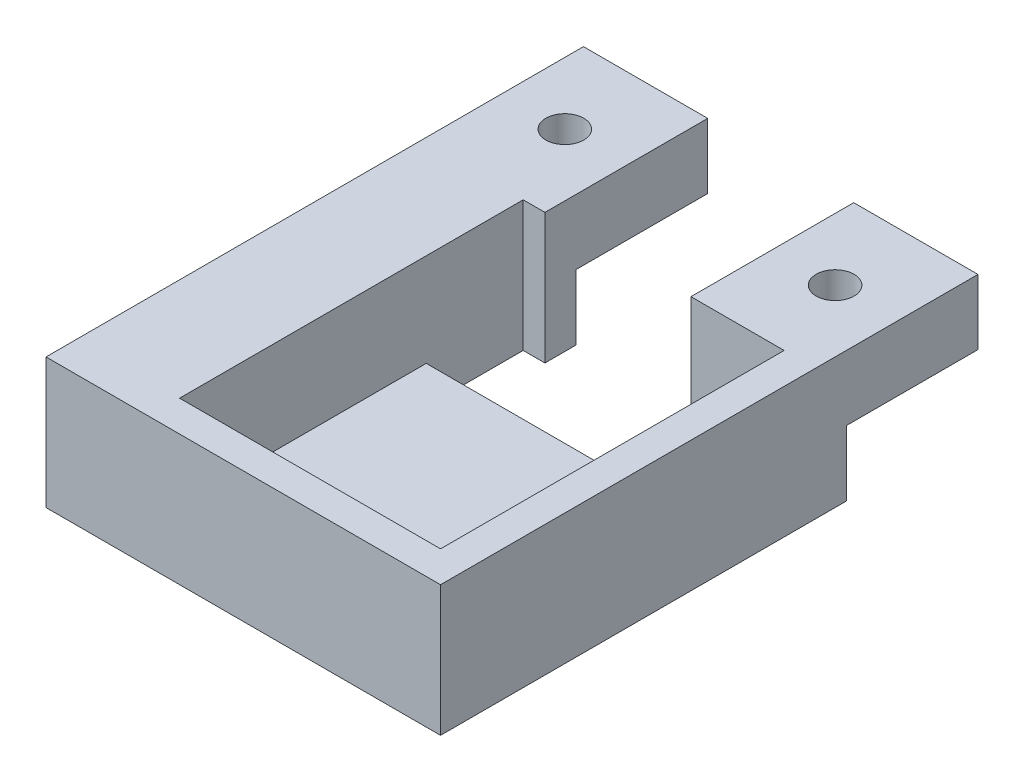
ISO-10303-21;
HEADER;
FILE_DESCRIPTION(('STEP AP214'),'2;1');
FILE_NAME('part.step','',(''),(''),'','','');
FILE_SCHEMA(('AUTOMOTIVE_DESIGN { 1 0 10303 214 1 1 1 1 }'));
ENDSEC;
DATA;
#1=APPLICATION_CONTEXT('core data for automotive mechanical design processes');
#2=APPLICATION_PROTOCOL_DEFINITION('international standard','automotive_design',2000,#1);
#3=PRODUCT_CONTEXT('',#1,'mechanical');
#4=PRODUCT('Part','Part','',(#3));
#5=PRODUCT_RELATED_PRODUCT_CATEGORY('part','',(#4));
#6=PRODUCT_DEFINITION_FORMATION('','',#4);
#7=PRODUCT_DEFINITION_CONTEXT('part definition',#1,'design');
#8=PRODUCT_DEFINITION('design','',#6,#7);
#9=PRODUCT_DEFINITION_SHAPE('','',#8);
#10=(LENGTH_UNIT() NAMED_UNIT(*) SI_UNIT(.MILLI.,.METRE.));
#11=(NAMED_UNIT(*) PLANE_ANGLE_UNIT() SI_UNIT($,.RADIAN.));
#12=(NAMED_UNIT(*) SI_UNIT($,.STERADIAN.) SOLID_ANGLE_UNIT());
#13=UNCERTAINTY_MEASURE_WITH_UNIT(LENGTH_MEASURE(1.E-05),#10,'distance_accuracy_value','');
#14=(GEOMETRIC_REPRESENTATION_CONTEXT(3) GLOBAL_UNCERTAINTY_ASSIGNED_CONTEXT((#13)) GLOBAL_UNIT_ASSIGNED_CONTEXT((#10,
#11,#12)) REPRESENTATION_CONTEXT('',''));
#15=CARTESIAN_POINT('',(0.,0.,0.));
#16=DIRECTION('',(0.,0.,1.));
#17=DIRECTION('',(1.,0.,0.));
#18=AXIS2_PLACEMENT_3D('',#15,#16,#17);
#19=CARTESIAN_POINT('',(21.,6.,0.));
#20=DIRECTION('',(-1.,0.,0.));
#21=DIRECTION('',(0.,0.,1.));
#22=AXIS2_PLACEMENT_3D('',#19,#20,#21);
#23=PLANE('',#22);
#24=DIRECTION('',(0.,0.,-1.));
#25=VECTOR('',#24,1.);
#26=CARTESIAN_POINT('',(21.,0.,0.));
#27=LINE('',#26,#25);
#28=CARTESIAN_POINT('',(21.,0.,-19.85));
#29=VERTEX_POINT('',#28);
#30=CARTESIAN_POINT('',(21.,0.,-35.45));
#31=VERTEX_POINT('',#30);
#32=EDGE_CURVE('E280',#29,#31,#27,.T.);
#33=ORIENTED_EDGE('',*,*,#32,.F.);
#34=DIRECTION('',(0.,-1.,0.));
#35=VECTOR('',#34,1.);
#36=CARTESIAN_POINT('',(21.,6.,-19.85));
#37=LINE('',#36,#35);
#38=CARTESIAN_POINT('',(21.,6.,-19.85));
#39=VERTEX_POINT('',#38);
#40=EDGE_CURVE('E12',#39,#29,#37,.T.);
#41=ORIENTED_EDGE('',*,*,#40,.F.);
#42=DIRECTION('',(0.,0.,1.));
#43=VECTOR('',#42,1.);
#44=CARTESIAN_POINT('',(21.,6.,0.));
#45=LINE('',#44,#43);
#46=CARTESIAN_POINT('',(21.,6.,19.85));
#47=VERTEX_POINT('',#46);
#48=EDGE_CURVE('E278',#39,#47,#45,.T.);
#49=ORIENTED_EDGE('',*,*,#48,.T.);
#50=DIRECTION('',(0.,-1.,0.));
#51=VECTOR('',#50,1.);
#52=CARTESIAN_POINT('',(21.,21.,19.85));
#53=LINE('',#52,#51);
#54=CARTESIAN_POINT('',(21.,21.,19.85));
#55=VERTEX_POINT('',#54);
#56=EDGE_CURVE('E270',#55,#47,#53,.T.);
#57=ORIENTED_EDGE('',*,*,#56,.F.);
#58=DIRECTION('',(0.,0.,-1.));
#59=VECTOR('',#58,1.);
#60=CARTESIAN_POINT('',(21.,21.,0.));
#61=LINE('',#60,#59);
#62=CARTESIAN_POINT('',(21.,21.,-35.45));
#63=VERTEX_POINT('',#62);
#64=EDGE_CURVE('E244',#55,#63,#61,.T.);
#65=ORIENTED_EDGE('',*,*,#64,.T.);
#66=DIRECTION('',(0.,-1.,0.));
#67=VECTOR('',#66,1.);
#68=CARTESIAN_POINT('',(21.,6.,-35.45));
#69=LINE('',#68,#67);
#70=EDGE_CURVE('E284',#63,#31,#69,.T.);
#71=ORIENTED_EDGE('',*,*,#70,.T.);
#72=EDGE_LOOP('',(#33,#41,#49,#57,#65,#71));
#73=FACE_BOUND('',#72,.T.);
#74=ADVANCED_FACE('F65',(#73),#23,.T.);
#75=CARTESIAN_POINT('',(0.,6.,-19.85));
#76=DIRECTION('',(0.,0.,-1.));
#77=DIRECTION('',(-1.,0.,0.));
#78=AXIS2_PLACEMENT_3D('',#75,#76,#77);
#79=PLANE('',#78);
#80=DIRECTION('',(1.,0.,0.));
#81=VECTOR('',#80,1.);
#82=CARTESIAN_POINT('',(0.,0.,-19.85));
#83=LINE('',#82,#81);
#84=CARTESIAN_POINT('',(-21.,0.,-19.85));
#85=VERTEX_POINT('',#84);
#86=EDGE_CURVE('E288',#85,#29,#83,.T.);
#87=ORIENTED_EDGE('',*,*,#86,.F.);
#88=DIRECTION('',(0.,-1.,0.));
#89=VECTOR('',#88,1.);
#90=CARTESIAN_POINT('',(-21.,6.,-19.85));
#91=LINE('',#90,#89);
#92=CARTESIAN_POINT('',(-21.,6.,-19.85));
#93=VERTEX_POINT('',#92);
#94=EDGE_CURVE('E72',#93,#85,#91,.T.);
#95=ORIENTED_EDGE('',*,*,#94,.F.);
#96=DIRECTION('',(1.,0.,0.));
#97=VECTOR('',#96,1.);
#98=CARTESIAN_POINT('',(0.,6.,-19.85));
#99=LINE('',#98,#97);
#100=EDGE_CURVE('E281',#93,#39,#99,.T.);
#101=ORIENTED_EDGE('',*,*,#100,.T.);
#102=ORIENTED_EDGE('',*,*,#40,.T.);
#103=EDGE_LOOP('',(#87,#95,#101,#102));
#104=FACE_BOUND('',#103,.T.);
#105=ADVANCED_FACE('F347',(#104),#79,.T.);
#106=CARTESIAN_POINT('',(-21.,6.,0.));
#107=DIRECTION('',(-1.,0.,0.));
#108=DIRECTION('',(0.,0.,1.));
#109=AXIS2_PLACEMENT_3D('',#106,#107,#108);
#110=PLANE('',#109);
#111=DIRECTION('',(0.,0.,-1.));
#112=VECTOR('',#111,1.);
#113=CARTESIAN_POINT('',(-21.,0.,0.));
#114=LINE('',#113,#112);
#115=CARTESIAN_POINT('',(-21.,0.,-35.45));
#116=VERTEX_POINT('',#115);
#117=EDGE_CURVE('E291',#85,#116,#114,.T.);
#118=ORIENTED_EDGE('',*,*,#117,.T.);
#119=DIRECTION('',(0.,-1.,0.));
#120=VECTOR('',#119,1.);
#121=CARTESIAN_POINT('',(-21.,6.,-35.45));
#122=LINE('',#121,#120);
#123=CARTESIAN_POINT('',(-21.,21.,-35.45));
#124=VERTEX_POINT('',#123);
#125=EDGE_CURVE('E336',#124,#116,#122,.T.);
#126=ORIENTED_EDGE('',*,*,#125,.F.);
#127=DIRECTION('',(0.,0.,-1.));
#128=VECTOR('',#127,1.);
#129=CARTESIAN_POINT('',(-21.,21.,0.));
#130=LINE('',#129,#128);
#131=CARTESIAN_POINT('',(-21.,21.,19.85));
#132=VERTEX_POINT('',#131);
#133=EDGE_CURVE('E250',#132,#124,#130,.T.);
#134=ORIENTED_EDGE('',*,*,#133,.F.);
#135=DIRECTION('',(0.,-1.,0.));
#136=VECTOR('',#135,1.);
#137=CARTESIAN_POINT('',(-21.,21.,19.85));
#138=LINE('',#137,#136);
#139=CARTESIAN_POINT('',(-21.,6.,19.85));
#140=VERTEX_POINT('',#139);
#141=EDGE_CURVE('E267',#132,#140,#138,.T.);
#142=ORIENTED_EDGE('',*,*,#141,.T.);
#143=DIRECTION('',(0.,0.,1.));
#144=VECTOR('',#143,1.);
#145=CARTESIAN_POINT('',(-21.,6.,0.));
#146=LINE('',#145,#144);
#147=EDGE_CURVE('E273',#93,#140,#146,.T.);
#148=ORIENTED_EDGE('',*,*,#147,.F.);
#149=ORIENTED_EDGE('',*,*,#94,.T.);
#150=EDGE_LOOP('',(#118,#126,#134,#142,#148,#149));
#151=FACE_BOUND('',#150,.T.);
#152=ADVANCED_FACE('F340',(#151),#110,.F.);
#153=CARTESIAN_POINT('',(0.,6.,-35.45));
#154=DIRECTION('',(0.,0.,1.));
#155=DIRECTION('',(1.,0.,0.));
#156=AXIS2_PLACEMENT_3D('',#153,#154,#155);
#157=PLANE('',#156);
#158=DIRECTION('',(-1.,0.,0.));
#159=VECTOR('',#158,1.);
#160=CARTESIAN_POINT('',(0.,0.,-35.45));
#161=LINE('',#160,#159);
#162=CARTESIAN_POINT('',(-17.5,0.,-35.45));
#163=VERTEX_POINT('',#162);
#164=EDGE_CURVE('E294',#163,#116,#161,.T.);
#165=ORIENTED_EDGE('',*,*,#164,.F.);
#166=DIRECTION('',(0.,-1.,0.));
#167=VECTOR('',#166,1.);
#168=CARTESIAN_POINT('',(-17.5,6.,-35.45));
#169=LINE('',#168,#167);
#170=CARTESIAN_POINT('',(-17.5,21.,-35.45));
#171=VERTEX_POINT('',#170);
#172=EDGE_CURVE('E334',#171,#163,#169,.T.);
#173=ORIENTED_EDGE('',*,*,#172,.F.);
#174=DIRECTION('',(-1.,0.,0.));
#175=VECTOR('',#174,1.);
#176=CARTESIAN_POINT('',(0.,21.,-35.45));
#177=LINE('',#176,#175);
#178=EDGE_CURVE('E253',#171,#124,#177,.T.);
#179=ORIENTED_EDGE('',*,*,#178,.T.);
#180=ORIENTED_EDGE('',*,*,#125,.T.);
#181=EDGE_LOOP('',(#165,#173,#179,#180));
#182=FACE_BOUND('',#181,.T.);
#183=ADVANCED_FACE('F398',(#182),#157,.T.);
#184=CARTESIAN_POINT('',(-17.5000000000002,6.,0.));
#185=DIRECTION('',(1.,0.,0.));
#186=DIRECTION('',(0.,0.,-1.));
#187=AXIS2_PLACEMENT_3D('',#184,#185,#186);
#188=PLANE('',#187);
#189=DIRECTION('',(0.,0.,1.));
#190=VECTOR('',#189,1.);
#191=CARTESIAN_POINT('',(-17.5000000000002,0.,0.));
#192=LINE('',#191,#190);
#193=CARTESIAN_POINT('',(-17.5,0.,-40.45));
#194=VERTEX_POINT('',#193);
#195=EDGE_CURVE('E297',#194,#163,#192,.T.);
#196=ORIENTED_EDGE('',*,*,#195,.F.);
#197=DIRECTION('',(0.,-1.,0.));
#198=VECTOR('',#197,1.);
#199=CARTESIAN_POINT('',(-17.5,6.,-40.45));
#200=LINE('',#199,#198);
#201=CARTESIAN_POINT('',(-17.5,10.52,-40.45));
#202=VERTEX_POINT('',#201);
#203=EDGE_CURVE('E332',#202,#194,#200,.T.);
#204=ORIENTED_EDGE('',*,*,#203,.F.);
#205=DIRECTION('',(0.,0.,1.));
#206=VECTOR('',#205,1.);
#207=CARTESIAN_POINT('',(-17.5,10.52,0.));
#208=LINE('',#207,#206);
#209=CARTESIAN_POINT('',(-17.5,10.52,-61.65));
#210=VERTEX_POINT('',#209);
#211=EDGE_CURVE('E222',#210,#202,#208,.T.);
#212=ORIENTED_EDGE('',*,*,#211,.F.);
#213=DIRECTION('',(0.,1.,0.));
#214=VECTOR('',#213,1.);
#215=CARTESIAN_POINT('',(-17.5,10.52,-61.65));
#216=LINE('',#215,#214);
#217=CARTESIAN_POINT('',(-17.5,21.,-61.65));
#218=VERTEX_POINT('',#217);
#219=EDGE_CURVE('E232',#210,#218,#216,.T.);
#220=ORIENTED_EDGE('',*,*,#219,.T.);
#221=DIRECTION('',(0.,0.,1.));
#222=VECTOR('',#221,1.);
#223=CARTESIAN_POINT('',(-17.5000000000002,21.,0.));
#224=LINE('',#223,#222);
#225=EDGE_CURVE('E256',#218,#171,#224,.T.);
#226=ORIENTED_EDGE('',*,*,#225,.T.);
#227=ORIENTED_EDGE('',*,*,#172,.T.);
#228=EDGE_LOOP('',(#196,#204,#212,#220,#226,#227));
#229=FACE_BOUND('',#228,.T.);
#230=ADVANCED_FACE('F403',(#229),#188,.T.);
#231=CARTESIAN_POINT('',(0.,6.,-40.45));
#232=DIRECTION('',(0.,0.,-1.));
#233=DIRECTION('',(-1.,0.,0.));
#234=AXIS2_PLACEMENT_3D('',#231,#232,#233);
#235=PLANE('',#234);
#236=DIRECTION('',(-1.,0.,0.));
#237=VECTOR('',#236,1.);
#238=CARTESIAN_POINT('',(0.,10.52,-40.45));
#239=LINE('',#238,#237);
#240=CARTESIAN_POINT('',(-37.5,10.52,-40.45));
#241=VERTEX_POINT('',#240);
#242=EDGE_CURVE('E225',#202,#241,#239,.T.);
#243=ORIENTED_EDGE('',*,*,#242,.F.);
#244=ORIENTED_EDGE('',*,*,#203,.T.);
#245=DIRECTION('',(1.,0.,0.));
#246=VECTOR('',#245,1.);
#247=CARTESIAN_POINT('',(0.,0.,-40.45));
#248=LINE('',#247,#246);
#249=CARTESIAN_POINT('',(-37.5,0.,-40.45));
#250=VERTEX_POINT('',#249);
#251=EDGE_CURVE('E300',#250,#194,#248,.T.);
#252=ORIENTED_EDGE('',*,*,#251,.F.);
#253=DIRECTION('',(0.,-1.,0.));
#254=VECTOR('',#253,1.);
#255=CARTESIAN_POINT('',(-37.5,6.,-40.45));
#256=LINE('',#255,#254);
#257=EDGE_CURVE('E330',#241,#250,#256,.T.);
#258=ORIENTED_EDGE('',*,*,#257,.F.);
#259=EDGE_LOOP('',(#243,#244,#252,#258));
#260=FACE_BOUND('',#259,.T.);
#261=ADVANCED_FACE('F407',(#260),#235,.T.);
#262=CARTESIAN_POINT('',(-37.5,6.,0.));
#263=DIRECTION('',(1.,0.,0.));
#264=DIRECTION('',(0.,0.,-1.));
#265=AXIS2_PLACEMENT_3D('',#262,#263,#264);
#266=PLANE('',#265);
#267=DIRECTION('',(0.,0.,1.));
#268=VECTOR('',#267,1.);
#269=CARTESIAN_POINT('',(-37.5,0.,0.));
#270=LINE('',#269,#268);
#271=CARTESIAN_POINT('',(-37.5,0.,24.85));
#272=VERTEX_POINT('',#271);
#273=EDGE_CURVE('E303',#250,#272,#270,.T.);
#274=ORIENTED_EDGE('',*,*,#273,.T.);
#275=DIRECTION('',(0.,-1.,0.));
#276=VECTOR('',#275,1.);
#277=CARTESIAN_POINT('',(-37.5,6.,24.85));
#278=LINE('',#277,#276);
#279=CARTESIAN_POINT('',(-37.5,21.,24.85));
#280=VERTEX_POINT('',#279);
#281=EDGE_CURVE('E327',#280,#272,#278,.T.);
#282=ORIENTED_EDGE('',*,*,#281,.F.);
#283=DIRECTION('',(0.,0.,1.));
#284=VECTOR('',#283,1.);
#285=CARTESIAN_POINT('',(-37.5,21.,0.));
#286=LINE('',#285,#284);
#287=CARTESIAN_POINT('',(-37.5,21.,-61.65));
#288=VERTEX_POINT('',#287);
#289=EDGE_CURVE('E259',#288,#280,#286,.T.);
#290=ORIENTED_EDGE('',*,*,#289,.F.);
#291=DIRECTION('',(0.,1.,0.));
#292=VECTOR('',#291,1.);
#293=CARTESIAN_POINT('',(-37.5,10.52,-61.65));
#294=LINE('',#293,#292);
#295=CARTESIAN_POINT('',(-37.5,10.52,-61.65));
#296=VERTEX_POINT('',#295);
#297=EDGE_CURVE('E237',#296,#288,#294,.T.);
#298=ORIENTED_EDGE('',*,*,#297,.F.);
#299=DIRECTION('',(0.,0.,-1.));
#300=VECTOR('',#299,1.);
#301=CARTESIAN_POINT('',(-37.5,10.52,0.));
#302=LINE('',#301,#300);
#303=EDGE_CURVE('E228',#241,#296,#302,.T.);
#304=ORIENTED_EDGE('',*,*,#303,.F.);
#305=ORIENTED_EDGE('',*,*,#257,.T.);
#306=EDGE_LOOP('',(#274,#282,#290,#298,#304,#305));
#307=FACE_BOUND('',#306,.T.);
#308=ADVANCED_FACE('F411',(#307),#266,.F.);
#309=CARTESIAN_POINT('',(0.,6.,24.85));
#310=DIRECTION('',(0.,0.,-1.));
#311=DIRECTION('',(-1.,0.,0.));
#312=AXIS2_PLACEMENT_3D('',#309,#310,#311);
#313=PLANE('',#312);
#314=DIRECTION('',(1.,0.,0.));
#315=VECTOR('',#314,1.);
#316=CARTESIAN_POINT('',(0.,0.,24.85));
#317=LINE('',#316,#315);
#318=CARTESIAN_POINT('',(26.,0.,24.85));
#319=VERTEX_POINT('',#318);
#320=EDGE_CURVE('E305',#272,#319,#317,.T.);
#321=ORIENTED_EDGE('',*,*,#320,.T.);
#322=DIRECTION('',(0.,-1.,0.));
#323=VECTOR('',#322,1.);
#324=CARTESIAN_POINT('',(26.,6.,24.85));
#325=LINE('',#324,#323);
#326=CARTESIAN_POINT('',(26.,21.,24.85));
#327=VERTEX_POINT('',#326);
#328=EDGE_CURVE('E324',#327,#319,#325,.T.);
#329=ORIENTED_EDGE('',*,*,#328,.F.);
#330=DIRECTION('',(1.,0.,0.));
#331=VECTOR('',#330,1.);
#332=CARTESIAN_POINT('',(0.,21.,24.85));
#333=LINE('',#332,#331);
#334=EDGE_CURVE('E262',#280,#327,#333,.T.);
#335=ORIENTED_EDGE('',*,*,#334,.F.);
#336=ORIENTED_EDGE('',*,*,#281,.T.);
#337=EDGE_LOOP('',(#321,#329,#335,#336));
#338=FACE_BOUND('',#337,.T.);
#339=ADVANCED_FACE('F415',(#338),#313,.F.);
#340=CARTESIAN_POINT('',(26.,6.,0.));
#341=DIRECTION('',(-1.,0.,0.));
#342=DIRECTION('',(0.,0.,1.));
#343=AXIS2_PLACEMENT_3D('',#340,#341,#342);
#344=PLANE('',#343);
#345=DIRECTION('',(0.,0.,-1.));
#346=VECTOR('',#345,1.);
#347=CARTESIAN_POINT('',(26.,0.,0.));
#348=LINE('',#347,#346);
#349=CARTESIAN_POINT('',(26.,0.,-40.45));
#350=VERTEX_POINT('',#349);
#351=EDGE_CURVE('E307',#319,#350,#348,.T.);
#352=ORIENTED_EDGE('',*,*,#351,.T.);
#353=DIRECTION('',(0.,-1.,0.));
#354=VECTOR('',#353,1.);
#355=CARTESIAN_POINT('',(26.,6.,-40.45));
#356=LINE('',#355,#354);
#357=CARTESIAN_POINT('',(26.,10.52,-40.45));
#358=VERTEX_POINT('',#357);
#359=EDGE_CURVE('E322',#358,#350,#356,.T.);
#360=ORIENTED_EDGE('',*,*,#359,.F.);
#361=DIRECTION('',(0.,0.,1.));
#362=VECTOR('',#361,1.);
#363=CARTESIAN_POINT('',(26.,10.52,0.));
#364=LINE('',#363,#362);
#365=CARTESIAN_POINT('',(26.,10.52,-61.65));
#366=VERTEX_POINT('',#365);
#367=EDGE_CURVE('E213',#366,#358,#364,.T.);
#368=ORIENTED_EDGE('',*,*,#367,.F.);
#369=DIRECTION('',(0.,1.,0.));
#370=VECTOR('',#369,1.);
#371=CARTESIAN_POINT('',(26.,10.52,-61.65));
#372=LINE('',#371,#370);
#373=CARTESIAN_POINT('',(26.,21.,-61.65));
#374=VERTEX_POINT('',#373);
#375=EDGE_CURVE('E203',#366,#374,#372,.T.);
#376=ORIENTED_EDGE('',*,*,#375,.T.);
#377=DIRECTION('',(0.,0.,-1.));
#378=VECTOR('',#377,1.);
#379=CARTESIAN_POINT('',(26.,21.,0.));
#380=LINE('',#379,#378);
#381=EDGE_CURVE('E265',#327,#374,#380,.T.);
#382=ORIENTED_EDGE('',*,*,#381,.F.);
#383=ORIENTED_EDGE('',*,*,#328,.T.);
#384=EDGE_LOOP('',(#352,#360,#368,#376,#382,#383));
#385=FACE_BOUND('',#384,.T.);
#386=ADVANCED_FACE('F362',(#385),#344,.F.);
#387=CARTESIAN_POINT('',(0.,6.,-40.45));
#388=DIRECTION('',(0.,0.,-1.));
#389=DIRECTION('',(-1.,0.,0.));
#390=AXIS2_PLACEMENT_3D('',#387,#388,#389);
#391=PLANE('',#390);
#392=DIRECTION('',(-1.,0.,0.));
#393=VECTOR('',#392,1.);
#394=CARTESIAN_POINT('',(0.,10.52,-40.45));
#395=LINE('',#394,#393);
#396=CARTESIAN_POINT('',(6.,10.52,-40.45));
#397=VERTEX_POINT('',#396);
#398=EDGE_CURVE('E79',#358,#397,#395,.T.);
#399=ORIENTED_EDGE('',*,*,#398,.F.);
#400=ORIENTED_EDGE('',*,*,#359,.T.);
#401=DIRECTION('',(1.,0.,0.));
#402=VECTOR('',#401,1.);
#403=CARTESIAN_POINT('',(0.,0.,-40.45));
#404=LINE('',#403,#402);
#405=CARTESIAN_POINT('',(6.,0.,-40.45));
#406=VERTEX_POINT('',#405);
#407=EDGE_CURVE('E310',#406,#350,#404,.T.);
#408=ORIENTED_EDGE('',*,*,#407,.F.);
#409=DIRECTION('',(0.,-1.,0.));
#410=VECTOR('',#409,1.);
#411=CARTESIAN_POINT('',(6.,6.,-40.45));
#412=LINE('',#411,#410);
#413=EDGE_CURVE('E84',#397,#406,#412,.T.);
#414=ORIENTED_EDGE('',*,*,#413,.F.);
#415=EDGE_LOOP('',(#399,#400,#408,#414));
#416=FACE_BOUND('',#415,.T.);
#417=ADVANCED_FACE('F422',(#416),#391,.T.);
#418=CARTESIAN_POINT('',(6.00000000000003,6.,0.));
#419=DIRECTION('',(1.,0.,0.));
#420=DIRECTION('',(0.,0.,-1.));
#421=AXIS2_PLACEMENT_3D('',#418,#419,#420);
#422=PLANE('',#421);
#423=DIRECTION('',(0.,0.,1.));
#424=VECTOR('',#423,1.);
#425=CARTESIAN_POINT('',(6.00000000000003,0.,0.));
#426=LINE('',#425,#424);
#427=CARTESIAN_POINT('',(6.00000000000001,0.,-35.45));
#428=VERTEX_POINT('',#427);
#429=EDGE_CURVE('E313',#406,#428,#426,.T.);
#430=ORIENTED_EDGE('',*,*,#429,.T.);
#431=DIRECTION('',(0.,-1.,0.));
#432=VECTOR('',#431,1.);
#433=CARTESIAN_POINT('',(6.00000000000001,6.,-35.45));
#434=LINE('',#433,#432);
#435=CARTESIAN_POINT('',(6.00000000000001,21.,-35.45));
#436=VERTEX_POINT('',#435);
#437=EDGE_CURVE('E318',#436,#428,#434,.T.);
#438=ORIENTED_EDGE('',*,*,#437,.F.);
#439=DIRECTION('',(0.,0.,1.));
#440=VECTOR('',#439,1.);
#441=CARTESIAN_POINT('',(6.00000000000003,21.,0.));
#442=LINE('',#441,#440);
#443=CARTESIAN_POINT('',(6.,21.,-61.65));
#444=VERTEX_POINT('',#443);
#445=EDGE_CURVE('E198',#444,#436,#442,.T.);
#446=ORIENTED_EDGE('',*,*,#445,.F.);
#447=DIRECTION('',(0.,1.,0.));
#448=VECTOR('',#447,1.);
#449=CARTESIAN_POINT('',(6.,10.52,-61.65));
#450=LINE('',#449,#448);
#451=CARTESIAN_POINT('',(6.,10.52,-61.65));
#452=VERTEX_POINT('',#451);
#453=EDGE_CURVE('E195',#452,#444,#450,.T.);
#454=ORIENTED_EDGE('',*,*,#453,.F.);
#455=DIRECTION('',(0.,0.,-1.));
#456=VECTOR('',#455,1.);
#457=CARTESIAN_POINT('',(6.,10.52,0.));
#458=LINE('',#457,#456);
#459=EDGE_CURVE('E185',#397,#452,#458,.T.);
#460=ORIENTED_EDGE('',*,*,#459,.F.);
#461=ORIENTED_EDGE('',*,*,#413,.T.);
#462=EDGE_LOOP('',(#430,#438,#446,#454,#460,#461));
#463=FACE_BOUND('',#462,.T.);
#464=ADVANCED_FACE('F196',(#463),#422,.F.);
#465=CARTESIAN_POINT('',(0.,6.,-35.45));
#466=DIRECTION('',(0.,0.,-1.));
#467=DIRECTION('',(-1.,0.,0.));
#468=AXIS2_PLACEMENT_3D('',#465,#466,#467);
#469=PLANE('',#468);
#470=DIRECTION('',(1.,0.,0.));
#471=VECTOR('',#470,1.);
#472=CARTESIAN_POINT('',(0.,0.,-35.45));
#473=LINE('',#472,#471);
#474=EDGE_CURVE('E285',#428,#31,#473,.T.);
#475=ORIENTED_EDGE('',*,*,#474,.T.);
#476=ORIENTED_EDGE('',*,*,#70,.F.);
#477=DIRECTION('',(1.,0.,0.));
#478=VECTOR('',#477,1.);
#479=CARTESIAN_POINT('',(0.,21.,-35.45));
#480=LINE('',#479,#478);
#481=EDGE_CURVE('E241',#436,#63,#480,.T.);
#482=ORIENTED_EDGE('',*,*,#481,.F.);
#483=ORIENTED_EDGE('',*,*,#437,.T.);
#484=EDGE_LOOP('',(#475,#476,#482,#483));
#485=FACE_BOUND('',#484,.T.);
#486=ADVANCED_FACE('F354',(#485),#469,.F.);
#487=CARTESIAN_POINT('',(0.,6.,0.));
#488=DIRECTION('',(0.,1.,0.));
#489=DIRECTION('',(0.,0.,1.));
#490=AXIS2_PLACEMENT_3D('',#487,#488,#489);
#491=PLANE('',#490);
#492=ORIENTED_EDGE('',*,*,#48,.F.);
#493=ORIENTED_EDGE('',*,*,#100,.F.);
#494=ORIENTED_EDGE('',*,*,#147,.T.);
#495=DIRECTION('',(-1.,0.,0.));
#496=VECTOR('',#495,1.);
#497=CARTESIAN_POINT('',(0.,6.,19.85));
#498=LINE('',#497,#496);
#499=EDGE_CURVE('E276',#47,#140,#498,.T.);
#500=ORIENTED_EDGE('',*,*,#499,.F.);
#501=EDGE_LOOP('',(#492,#493,#494,#500));
#502=FACE_BOUND('',#501,.T.);
#503=ADVANCED_FACE('F429',(#502),#491,.T.);
#504=CARTESIAN_POINT('',(0.,0.,0.));
#505=DIRECTION('',(0.,1.,0.));
#506=DIRECTION('',(0.,0.,1.));
#507=AXIS2_PLACEMENT_3D('',#504,#505,#506);
#508=PLANE('',#507);
#509=ORIENTED_EDGE('',*,*,#86,.T.);
#510=ORIENTED_EDGE('',*,*,#32,.T.);
#511=ORIENTED_EDGE('',*,*,#474,.F.);
#512=ORIENTED_EDGE('',*,*,#429,.F.);
#513=ORIENTED_EDGE('',*,*,#407,.T.);
#514=ORIENTED_EDGE('',*,*,#351,.F.);
#515=ORIENTED_EDGE('',*,*,#320,.F.);
#516=ORIENTED_EDGE('',*,*,#273,.F.);
#517=ORIENTED_EDGE('',*,*,#251,.T.);
#518=ORIENTED_EDGE('',*,*,#195,.T.);
#519=ORIENTED_EDGE('',*,*,#164,.T.);
#520=ORIENTED_EDGE('',*,*,#117,.F.);
#521=EDGE_LOOP('',(#509,#510,#511,#512,#513,#514,#515,#516,#517,#518,#519,#520));
#522=FACE_BOUND('',#521,.T.);
#523=ADVANCED_FACE('F345',(#522),#508,.F.);
#524=CARTESIAN_POINT('',(0.,21.,19.85));
#525=DIRECTION('',(0.,0.,-1.));
#526=DIRECTION('',(-1.,0.,0.));
#527=AXIS2_PLACEMENT_3D('',#524,#525,#526);
#528=PLANE('',#527);
#529=ORIENTED_EDGE('',*,*,#56,.T.);
#530=ORIENTED_EDGE('',*,*,#499,.T.);
#531=ORIENTED_EDGE('',*,*,#141,.F.);
#532=DIRECTION('',(1.,0.,0.));
#533=VECTOR('',#532,1.);
#534=CARTESIAN_POINT('',(0.,21.,19.85));
#535=LINE('',#534,#533);
#536=EDGE_CURVE('E247',#132,#55,#535,.T.);
#537=ORIENTED_EDGE('',*,*,#536,.T.);
#538=EDGE_LOOP('',(#529,#530,#531,#537));
#539=FACE_BOUND('',#538,.T.);
#540=ADVANCED_FACE('F380',(#539),#528,.T.);
#541=CARTESIAN_POINT('',(0.,21.,0.));
#542=DIRECTION('',(0.,1.,0.));
#543=DIRECTION('',(0.,0.,1.));
#544=AXIS2_PLACEMENT_3D('',#541,#542,#543);
#545=PLANE('',#544);
#546=ORIENTED_EDGE('',*,*,#445,.T.);
#547=ORIENTED_EDGE('',*,*,#481,.T.);
#548=ORIENTED_EDGE('',*,*,#64,.F.);
#549=ORIENTED_EDGE('',*,*,#536,.F.);
#550=ORIENTED_EDGE('',*,*,#133,.T.);
#551=ORIENTED_EDGE('',*,*,#178,.F.);
#552=ORIENTED_EDGE('',*,*,#225,.F.);
#553=DIRECTION('',(1.,0.,0.));
#554=VECTOR('',#553,1.);
#555=CARTESIAN_POINT('',(0.,21.,-61.65));
#556=LINE('',#555,#554);
#557=EDGE_CURVE('E219',#288,#218,#556,.T.);
#558=ORIENTED_EDGE('',*,*,#557,.F.);
#559=ORIENTED_EDGE('',*,*,#289,.T.);
#560=ORIENTED_EDGE('',*,*,#334,.T.);
#561=ORIENTED_EDGE('',*,*,#381,.T.);
#562=DIRECTION('',(1.,0.,0.));
#563=VECTOR('',#562,1.);
#564=CARTESIAN_POINT('',(0.,21.,-61.65));
#565=LINE('',#564,#563);
#566=EDGE_CURVE('E212',#444,#374,#565,.T.);
#567=ORIENTED_EDGE('',*,*,#566,.F.);
#568=EDGE_LOOP('',(#546,#547,#548,#549,#550,#551,#552,#558,#559,#560,#561,#567));
#569=FACE_BOUND('',#568,.T.);
#570=CARTESIAN_POINT('',(-27.5,21.,-48.65));
#571=DIRECTION('',(0.,1.,0.));
#572=DIRECTION('',(0.,0.,1.));
#573=AXIS2_PLACEMENT_3D('',#570,#571,#572);
#574=CIRCLE('',#573,3.04999999999999);
#575=CARTESIAN_POINT('',(-27.5,21.,-45.6));
#576=VERTEX_POINT('',#575);
#577=EDGE_CURVE('E202',#576,#576,#574,.T.);
#578=ORIENTED_EDGE('',*,*,#577,.F.);
#579=EDGE_LOOP('',(#578));
#580=FACE_BOUND('',#579,.T.);
#581=CARTESIAN_POINT('',(16.,21.,-48.65));
#582=DIRECTION('',(0.,1.,0.));
#583=DIRECTION('',(0.,0.,1.));
#584=AXIS2_PLACEMENT_3D('',#581,#582,#583);
#585=CIRCLE('',#584,3.05);
#586=CARTESIAN_POINT('',(16.,21.,-45.6));
#587=VERTEX_POINT('',#586);
#588=EDGE_CURVE('E365',#587,#587,#585,.T.);
#589=ORIENTED_EDGE('',*,*,#588,.F.);
#590=EDGE_LOOP('',(#589));
#591=FACE_BOUND('',#590,.T.);
#592=ADVANCED_FACE('F358',(#569,#580,#591),#545,.T.);
#593=CARTESIAN_POINT('',(0.,10.52,-61.65));
#594=DIRECTION('',(0.,0.,1.));
#595=DIRECTION('',(1.,0.,0.));
#596=AXIS2_PLACEMENT_3D('',#593,#594,#595);
#597=PLANE('',#596);
#598=ORIENTED_EDGE('',*,*,#557,.T.);
#599=ORIENTED_EDGE('',*,*,#219,.F.);
#600=DIRECTION('',(1.,0.,0.));
#601=VECTOR('',#600,1.);
#602=CARTESIAN_POINT('',(0.,10.52,-61.65));
#603=LINE('',#602,#601);
#604=EDGE_CURVE('E230',#296,#210,#603,.T.);
#605=ORIENTED_EDGE('',*,*,#604,.F.);
#606=ORIENTED_EDGE('',*,*,#297,.T.);
#607=EDGE_LOOP('',(#598,#599,#605,#606));
#608=FACE_BOUND('',#607,.T.);
#609=ADVANCED_FACE('F379',(#608),#597,.F.);
#610=CARTESIAN_POINT('',(0.,10.52,0.));
#611=DIRECTION('',(0.,-1.,0.));
#612=DIRECTION('',(0.,0.,-1.));
#613=AXIS2_PLACEMENT_3D('',#610,#611,#612);
#614=PLANE('',#613);
#615=CARTESIAN_POINT('',(-27.5,10.52,-48.65));
#616=DIRECTION('',(0.,1.,0.));
#617=DIRECTION('',(0.,0.,1.));
#618=AXIS2_PLACEMENT_3D('',#615,#616,#617);
#619=CIRCLE('',#618,3.04999999999999);
#620=CARTESIAN_POINT('',(-27.5,10.52,-45.6));
#621=VERTEX_POINT('',#620);
#622=EDGE_CURVE('E216',#621,#621,#619,.T.);
#623=ORIENTED_EDGE('',*,*,#622,.T.);
#624=EDGE_LOOP('',(#623));
#625=FACE_BOUND('',#624,.T.);
#626=ORIENTED_EDGE('',*,*,#211,.T.);
#627=ORIENTED_EDGE('',*,*,#242,.T.);
#628=ORIENTED_EDGE('',*,*,#303,.T.);
#629=ORIENTED_EDGE('',*,*,#604,.T.);
#630=EDGE_LOOP('',(#626,#627,#628,#629));
#631=FACE_BOUND('',#630,.T.);
#632=ADVANCED_FACE('F386',(#625,#631),#614,.T.);
#633=CARTESIAN_POINT('',(-27.5,10.52,-48.65));
#634=DIRECTION('',(0.,1.,0.));
#635=DIRECTION('',(0.,0.,1.));
#636=AXIS2_PLACEMENT_3D('',#633,#634,#635);
#637=CYLINDRICAL_SURFACE('',#636,3.04999999999999);
#638=ORIENTED_EDGE('',*,*,#622,.F.);
#639=EDGE_LOOP('',(#638));
#640=FACE_BOUND('',#639,.T.);
#641=ORIENTED_EDGE('',*,*,#577,.T.);
#642=EDGE_LOOP('',(#641));
#643=FACE_BOUND('',#642,.T.);
#644=ADVANCED_FACE('F455',(#640,#643),#637,.F.);
#645=CARTESIAN_POINT('',(0.,10.52,-61.65));
#646=DIRECTION('',(0.,0.,1.));
#647=DIRECTION('',(1.,0.,0.));
#648=AXIS2_PLACEMENT_3D('',#645,#646,#647);
#649=PLANE('',#648);
#650=ORIENTED_EDGE('',*,*,#566,.T.);
#651=ORIENTED_EDGE('',*,*,#375,.F.);
#652=DIRECTION('',(1.,0.,0.));
#653=VECTOR('',#652,1.);
#654=CARTESIAN_POINT('',(0.,10.52,-61.65));
#655=LINE('',#654,#653);
#656=EDGE_CURVE('E190',#452,#366,#655,.T.);
#657=ORIENTED_EDGE('',*,*,#656,.F.);
#658=ORIENTED_EDGE('',*,*,#453,.T.);
#659=EDGE_LOOP('',(#650,#651,#657,#658));
#660=FACE_BOUND('',#659,.T.);
#661=ADVANCED_FACE('F205',(#660),#649,.F.);
#662=CARTESIAN_POINT('',(0.,10.52,0.));
#663=DIRECTION('',(0.,-1.,0.));
#664=DIRECTION('',(0.,0.,-1.));
#665=AXIS2_PLACEMENT_3D('',#662,#663,#664);
#666=PLANE('',#665);
#667=CARTESIAN_POINT('',(16.,10.52,-48.65));
#668=DIRECTION('',(0.,1.,0.));
#669=DIRECTION('',(0.,0.,1.));
#670=AXIS2_PLACEMENT_3D('',#667,#668,#669);
#671=CIRCLE('',#670,3.05);
#672=CARTESIAN_POINT('',(16.,10.52,-45.6));
#673=VERTEX_POINT('',#672);
#674=EDGE_CURVE('E214',#673,#673,#671,.T.);
#675=ORIENTED_EDGE('',*,*,#674,.T.);
#676=EDGE_LOOP('',(#675));
#677=FACE_BOUND('',#676,.T.);
#678=ORIENTED_EDGE('',*,*,#367,.T.);
#679=ORIENTED_EDGE('',*,*,#398,.T.);
#680=ORIENTED_EDGE('',*,*,#459,.T.);
#681=ORIENTED_EDGE('',*,*,#656,.T.);
#682=EDGE_LOOP('',(#678,#679,#680,#681));
#683=FACE_BOUND('',#682,.T.);
#684=ADVANCED_FACE('F188',(#677,#683),#666,.T.);
#685=CARTESIAN_POINT('',(16.,10.52,-48.65));
#686=DIRECTION('',(0.,1.,0.));
#687=DIRECTION('',(0.,0.,1.));
#688=AXIS2_PLACEMENT_3D('',#685,#686,#687);
#689=CYLINDRICAL_SURFACE('',#688,3.05);
#690=ORIENTED_EDGE('',*,*,#674,.F.);
#691=EDGE_LOOP('',(#690));
#692=FACE_BOUND('',#691,.T.);
#693=ORIENTED_EDGE('',*,*,#588,.T.);
#694=EDGE_LOOP('',(#693));
#695=FACE_BOUND('',#694,.T.);
#696=ADVANCED_FACE('F372',(#692,#695),#689,.F.);
#697=CLOSED_SHELL('',(#74,#105,#152,#183,#230,#261,#308,#339,#386,#417,#464,#486,#503,#523,#540,
#592,#609,#632,#644,#661,#684,#696));
#698=MANIFOLD_SOLID_BREP('B2',#697);
#699=ADVANCED_BREP_SHAPE_REPRESENTATION('',(#18,#698),#14);
#700=SHAPE_DEFINITION_REPRESENTATION(#9,#699);
ENDSEC;
END-ISO-10303-21;
